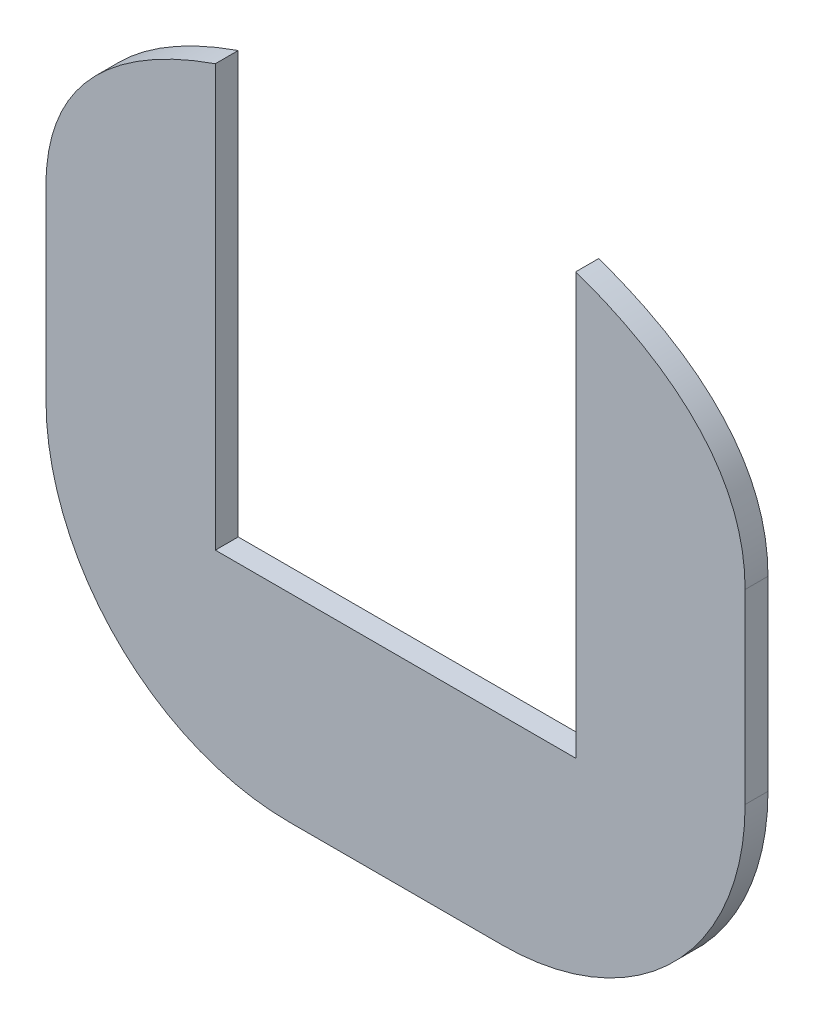
ISO-10303-21;
HEADER;
FILE_DESCRIPTION(('STEP AP214'),'2;1');
FILE_NAME('part.step','',(''),(''),'','','');
FILE_SCHEMA(('AUTOMOTIVE_DESIGN { 1 0 10303 214 1 1 1 1 }'));
ENDSEC;
DATA;
#1=APPLICATION_CONTEXT('core data for automotive mechanical design processes');
#2=APPLICATION_PROTOCOL_DEFINITION('international standard','automotive_design',2000,#1);
#3=PRODUCT_CONTEXT('',#1,'mechanical');
#4=PRODUCT('Part','Part','',(#3));
#5=PRODUCT_RELATED_PRODUCT_CATEGORY('part','',(#4));
#6=PRODUCT_DEFINITION_FORMATION('','',#4);
#7=PRODUCT_DEFINITION_CONTEXT('part definition',#1,'design');
#8=PRODUCT_DEFINITION('design','',#6,#7);
#9=PRODUCT_DEFINITION_SHAPE('','',#8);
#10=(LENGTH_UNIT() NAMED_UNIT(*) SI_UNIT(.MILLI.,.METRE.));
#11=(NAMED_UNIT(*) PLANE_ANGLE_UNIT() SI_UNIT($,.RADIAN.));
#12=(NAMED_UNIT(*) SI_UNIT($,.STERADIAN.) SOLID_ANGLE_UNIT());
#13=UNCERTAINTY_MEASURE_WITH_UNIT(LENGTH_MEASURE(1.E-05),#10,'distance_accuracy_value','');
#14=(GEOMETRIC_REPRESENTATION_CONTEXT(3) GLOBAL_UNCERTAINTY_ASSIGNED_CONTEXT((#13)) GLOBAL_UNIT_ASSIGNED_CONTEXT((#10,
#11,#12)) REPRESENTATION_CONTEXT('',''));
#15=CARTESIAN_POINT('',(0.,0.,0.));
#16=DIRECTION('',(0.,0.,1.));
#17=DIRECTION('',(1.,0.,0.));
#18=AXIS2_PLACEMENT_3D('',#15,#16,#17);
#19=CARTESIAN_POINT('',(-20.,-46.5,4.3));
#20=DIRECTION('',(0.,0.,-1.));
#21=DIRECTION('',(-1.,0.,0.));
#22=AXIS2_PLACEMENT_3D('',#19,#20,#21);
#23=CYLINDRICAL_SURFACE('',#22,45.7);
#24=CARTESIAN_POINT('',(-20.,-46.5,0.));
#25=DIRECTION('',(0.,0.,1.));
#26=DIRECTION('',(1.,0.,0.));
#27=AXIS2_PLACEMENT_3D('',#24,#25,#26);
#28=CIRCLE('',#27,45.7);
#29=CARTESIAN_POINT('',(-65.7,-46.5,0.));
#30=VERTEX_POINT('',#29);
#31=CARTESIAN_POINT('',(-20.,-92.2,0.));
#32=VERTEX_POINT('',#31);
#33=EDGE_CURVE('E177',#30,#32,#28,.T.);
#34=ORIENTED_EDGE('',*,*,#33,.T.);
#35=DIRECTION('',(0.,0.,-1.));
#36=VECTOR('',#35,1.);
#37=CARTESIAN_POINT('',(-20.,-92.2,4.3));
#38=LINE('',#37,#36);
#39=CARTESIAN_POINT('',(-20.,-92.2,4.3));
#40=VERTEX_POINT('',#39);
#41=EDGE_CURVE('E171',#40,#32,#38,.T.);
#42=ORIENTED_EDGE('',*,*,#41,.F.);
#43=CARTESIAN_POINT('',(-20.,-46.5,4.3));
#44=DIRECTION('',(0.,0.,1.));
#45=DIRECTION('',(1.,0.,0.));
#46=AXIS2_PLACEMENT_3D('',#43,#44,#45);
#47=CIRCLE('',#46,45.7);
#48=CARTESIAN_POINT('',(-65.7,-46.5,4.3));
#49=VERTEX_POINT('',#48);
#50=EDGE_CURVE('E201',#49,#40,#47,.T.);
#51=ORIENTED_EDGE('',*,*,#50,.F.);
#52=DIRECTION('',(0.,0.,-1.));
#53=VECTOR('',#52,1.);
#54=CARTESIAN_POINT('',(-65.7,-46.5,4.3));
#55=LINE('',#54,#53);
#56=EDGE_CURVE('E202',#49,#30,#55,.T.);
#57=ORIENTED_EDGE('',*,*,#56,.T.);
#58=EDGE_LOOP('',(#34,#42,#51,#57));
#59=FACE_BOUND('',#58,.T.);
#60=ADVANCED_FACE('F39',(#59),#23,.T.);
#61=CARTESIAN_POINT('',(-14.4294753014943,-92.2,4.3));
#62=DIRECTION('',(0.,1.,0.));
#63=DIRECTION('',(0.,0.,1.));
#64=AXIS2_PLACEMENT_3D('',#61,#62,#63);
#65=PLANE('',#64);
#66=DIRECTION('',(1.,0.,0.));
#67=VECTOR('',#66,1.);
#68=CARTESIAN_POINT('',(-14.4294753014943,-92.2,0.));
#69=LINE('',#68,#67);
#70=CARTESIAN_POINT('',(20.0000000000001,-92.2,0.));
#71=VERTEX_POINT('',#70);
#72=EDGE_CURVE('E167',#32,#71,#69,.T.);
#73=ORIENTED_EDGE('',*,*,#72,.T.);
#74=DIRECTION('',(0.,0.,-1.));
#75=VECTOR('',#74,1.);
#76=CARTESIAN_POINT('',(20.0000000000001,-92.2,4.3));
#77=LINE('',#76,#75);
#78=CARTESIAN_POINT('',(20.0000000000001,-92.2,4.3));
#79=VERTEX_POINT('',#78);
#80=EDGE_CURVE('E169',#79,#71,#77,.T.);
#81=ORIENTED_EDGE('',*,*,#80,.F.);
#82=DIRECTION('',(1.,0.,0.));
#83=VECTOR('',#82,1.);
#84=CARTESIAN_POINT('',(-20.,-92.2,4.3));
#85=LINE('',#84,#83);
#86=EDGE_CURVE('E98',#40,#79,#85,.T.);
#87=ORIENTED_EDGE('',*,*,#86,.F.);
#88=ORIENTED_EDGE('',*,*,#41,.T.);
#89=EDGE_LOOP('',(#73,#81,#87,#88));
#90=FACE_BOUND('',#89,.T.);
#91=ADVANCED_FACE('F160',(#90),#65,.F.);
#92=CARTESIAN_POINT('',(20.0000000000001,-46.5,4.3));
#93=DIRECTION('',(0.,0.,-1.));
#94=DIRECTION('',(-1.,0.,0.));
#95=AXIS2_PLACEMENT_3D('',#92,#93,#94);
#96=CYLINDRICAL_SURFACE('',#95,45.7);
#97=CARTESIAN_POINT('',(20.0000000000001,-46.5,0.));
#98=DIRECTION('',(0.,0.,1.));
#99=DIRECTION('',(1.,0.,0.));
#100=AXIS2_PLACEMENT_3D('',#97,#98,#99);
#101=CIRCLE('',#100,45.7);
#102=CARTESIAN_POINT('',(65.7000000000001,-46.5,0.));
#103=VERTEX_POINT('',#102);
#104=EDGE_CURVE('E176',#71,#103,#101,.T.);
#105=ORIENTED_EDGE('',*,*,#104,.T.);
#106=DIRECTION('',(0.,0.,-1.));
#107=VECTOR('',#106,1.);
#108=CARTESIAN_POINT('',(65.7000000000001,-46.5,4.3));
#109=LINE('',#108,#107);
#110=CARTESIAN_POINT('',(65.7000000000001,-46.5,4.3));
#111=VERTEX_POINT('',#110);
#112=EDGE_CURVE('E129',#111,#103,#109,.T.);
#113=ORIENTED_EDGE('',*,*,#112,.F.);
#114=CARTESIAN_POINT('',(20.0000000000001,-46.5,4.3));
#115=DIRECTION('',(0.,0.,1.));
#116=DIRECTION('',(1.,0.,0.));
#117=AXIS2_PLACEMENT_3D('',#114,#115,#116);
#118=CIRCLE('',#117,45.7);
#119=EDGE_CURVE('E116',#79,#111,#118,.T.);
#120=ORIENTED_EDGE('',*,*,#119,.F.);
#121=ORIENTED_EDGE('',*,*,#80,.T.);
#122=EDGE_LOOP('',(#105,#113,#120,#121));
#123=FACE_BOUND('',#122,.T.);
#124=ADVANCED_FACE('F158',(#123),#96,.T.);
#125=CARTESIAN_POINT('',(65.7,-11.5,4.3));
#126=DIRECTION('',(-1.,0.,0.));
#127=DIRECTION('',(0.,-1.,0.));
#128=AXIS2_PLACEMENT_3D('',#125,#126,#127);
#129=PLANE('',#128);
#130=DIRECTION('',(0.,1.,0.));
#131=VECTOR('',#130,1.);
#132=CARTESIAN_POINT('',(65.7,-11.5,0.));
#133=LINE('',#132,#131);
#134=CARTESIAN_POINT('',(65.7,-11.5,0.));
#135=VERTEX_POINT('',#134);
#136=EDGE_CURVE('E125',#103,#135,#133,.T.);
#137=ORIENTED_EDGE('',*,*,#136,.T.);
#138=DIRECTION('',(0.,0.,-1.));
#139=VECTOR('',#138,1.);
#140=CARTESIAN_POINT('',(65.7,-11.5,4.3));
#141=LINE('',#140,#139);
#142=CARTESIAN_POINT('',(65.7,-11.5,4.3));
#143=VERTEX_POINT('',#142);
#144=EDGE_CURVE('E122',#143,#135,#141,.T.);
#145=ORIENTED_EDGE('',*,*,#144,.F.);
#146=DIRECTION('',(0.,1.,0.));
#147=VECTOR('',#146,1.);
#148=CARTESIAN_POINT('',(65.7,-11.5,4.3));
#149=LINE('',#148,#147);
#150=EDGE_CURVE('E108',#111,#143,#149,.T.);
#151=ORIENTED_EDGE('',*,*,#150,.F.);
#152=ORIENTED_EDGE('',*,*,#112,.T.);
#153=EDGE_LOOP('',(#137,#145,#151,#152));
#154=FACE_BOUND('',#153,.T.);
#155=ADVANCED_FACE('F123',(#154),#129,.F.);
#156=CARTESIAN_POINT('',(65.7,-11.5,4.3));
#157=CARTESIAN_POINT('',(65.7,-10.9755899583671,4.3));
#158=CARTESIAN_POINT('',(65.677234407799,-9.91549097796304,4.3));
#159=CARTESIAN_POINT('',(65.5441870414575,-7.88841293925266,4.3));
#160=CARTESIAN_POINT('',(65.220242617562,-5.46067195182682,4.3));
#161=CARTESIAN_POINT('',(64.5980627687172,-2.72371582524321,4.3));
#162=CARTESIAN_POINT('',(63.4785155326464,0.716203599535267,4.3));
#163=CARTESIAN_POINT('',(61.5699490088853,4.65452752002481,4.3));
#164=CARTESIAN_POINT('',(58.5534228762426,8.88527505087892,4.3));
#165=CARTESIAN_POINT('',(54.896250472532,12.6626147651157,4.3));
#166=CARTESIAN_POINT('',(49.3051589495504,17.1177502677086,4.3));
#167=CARTESIAN_POINT('',(41.2794443055255,21.6169423973493,4.3));
#168=CARTESIAN_POINT('',(32.8026150450985,24.7807297336521,4.3));
#169=CARTESIAN_POINT('',(26.3389158503498,26.6062450199433,4.3));
#170=CARTESIAN_POINT('',(21.7972115308563,27.6517809376323,4.3));
#171=CARTESIAN_POINT('',(17.7102182701353,28.403936400297,4.3));
#172=CARTESIAN_POINT('',(14.8086873614499,28.8127381630495,4.3));
#173=CARTESIAN_POINT('',(12.8723127777568,29.0253496461649,4.3));
#174=CARTESIAN_POINT('',(11.6336485809542,29.1318563530486,4.3));
#175=CARTESIAN_POINT('',(10.8115232746335,29.1802031883283,4.3));
#176=CARTESIAN_POINT('',(10.2829881458273,29.1975933707137,4.3));
#177=CARTESIAN_POINT('',(10.1012123889315,29.2,4.3));
#178=CARTESIAN_POINT('',(10.,29.2,4.3));
#179=B_SPLINE_CURVE_WITH_KNOTS('',3,(#156,#157,#158,#159,#160,#161,#162,#163,#164,#165,#166,
#167,#168,#169,#170,#171,#172,#173,#174,#175,#176,#177,#178),.UNSPECIFIED.,.F.,.F.,(4,1,1,1,1,1,
1,1,1,1,1,1,1,1,1,1,1,1,1,1,4),(0.,0.015625,0.03125,0.0625,0.09375,0.125,0.1875,0.25,0.3125,
0.375,0.5,0.625,0.6875,0.75,0.8125,0.875,0.90625,0.9375,0.96875,0.984375,1.),.UNSPECIFIED.);
#180=DIRECTION('',(0.,0.,-1.));
#181=VECTOR('',#180,1.);
#182=SURFACE_OF_LINEAR_EXTRUSION('',#179,#181);
#183=CARTESIAN_POINT('',(65.7,-11.5,0.));
#184=CARTESIAN_POINT('',(65.7,-10.9755899583671,0.));
#185=CARTESIAN_POINT('',(65.677234407799,-9.91549097796304,0.));
#186=CARTESIAN_POINT('',(65.5441870414575,-7.88841293925266,0.));
#187=CARTESIAN_POINT('',(65.220242617562,-5.46067195182682,0.));
#188=CARTESIAN_POINT('',(64.5980627687172,-2.72371582524321,0.));
#189=CARTESIAN_POINT('',(63.4785155326464,0.716203599535267,0.));
#190=CARTESIAN_POINT('',(61.5699490088853,4.65452752002481,0.));
#191=CARTESIAN_POINT('',(58.5534228762426,8.88527505087892,0.));
#192=CARTESIAN_POINT('',(54.896250472532,12.6626147651157,0.));
#193=CARTESIAN_POINT('',(49.3051589495504,17.1177502677086,0.));
#194=CARTESIAN_POINT('',(41.2794443055255,21.6169423973493,0.));
#195=CARTESIAN_POINT('',(32.8026150450985,24.7807297336521,0.));
#196=CARTESIAN_POINT('',(26.3389158503498,26.6062450199433,0.));
#197=CARTESIAN_POINT('',(21.7972115308563,27.6517809376323,0.));
#198=CARTESIAN_POINT('',(17.7102182701353,28.403936400297,0.));
#199=CARTESIAN_POINT('',(14.8086873614499,28.8127381630495,0.));
#200=CARTESIAN_POINT('',(12.8723127777568,29.0253496461649,0.));
#201=CARTESIAN_POINT('',(11.6336485809542,29.1318563530486,0.));
#202=CARTESIAN_POINT('',(10.8115232746335,29.1802031883283,0.));
#203=CARTESIAN_POINT('',(10.2829881458273,29.1975933707137,0.));
#204=CARTESIAN_POINT('',(10.1012123889315,29.2,0.));
#205=CARTESIAN_POINT('',(10.,29.2,0.));
#206=B_SPLINE_CURVE_WITH_KNOTS('',3,(#183,#184,#185,#186,#187,#188,#189,#190,#191,#192,#193,
#194,#195,#196,#197,#198,#199,#200,#201,#202,#203,#204,#205),.UNSPECIFIED.,.F.,.F.,(4,1,1,1,1,1,
1,1,1,1,1,1,1,1,1,1,1,1,1,1,4),(0.,0.015625,0.03125,0.0625,0.09375,0.125,0.1875,0.25,0.3125,
0.375,0.5,0.625,0.6875,0.75,0.8125,0.875,0.90625,0.9375,0.96875,0.984375,1.),.UNSPECIFIED.);
#207=CARTESIAN_POINT('',(33.87,24.2997486559745,0.));
#208=VERTEX_POINT('',#207);
#209=EDGE_CURVE('E183',#135,#208,#206,.T.);
#210=ORIENTED_EDGE('',*,*,#209,.T.);
#211=DIRECTION('',(0.,0.,-1.));
#212=VECTOR('',#211,1.);
#213=CARTESIAN_POINT('',(33.87,24.2997486559022,4.3));
#214=LINE('',#213,#212);
#215=CARTESIAN_POINT('',(33.87,24.2997486559745,4.3));
#216=VERTEX_POINT('',#215);
#217=EDGE_CURVE('E135',#208,#216,#214,.F.);
#218=ORIENTED_EDGE('',*,*,#217,.T.);
#219=EDGE_CURVE('E114',#143,#216,#179,.T.);
#220=ORIENTED_EDGE('',*,*,#219,.F.);
#221=ORIENTED_EDGE('',*,*,#144,.T.);
#222=EDGE_LOOP('',(#210,#218,#220,#221));
#223=FACE_BOUND('',#222,.T.);
#224=ADVANCED_FACE('F133',(#223),#182,.F.);
#225=CARTESIAN_POINT('',(-10.,29.2,4.3));
#226=CARTESIAN_POINT('',(-10.1012123889315,29.2,4.3));
#227=CARTESIAN_POINT('',(-10.2829881458273,29.1975933707137,4.3));
#228=CARTESIAN_POINT('',(-10.8115232746335,29.1802031883283,4.3));
#229=CARTESIAN_POINT('',(-11.6336485809542,29.1318563530485,4.3));
#230=CARTESIAN_POINT('',(-12.8723127777568,29.0253496461649,4.3));
#231=CARTESIAN_POINT('',(-14.80868736145,28.8127381630495,4.3));
#232=CARTESIAN_POINT('',(-17.7102182701353,28.403936400297,4.3));
#233=CARTESIAN_POINT('',(-21.7972115308563,27.6517809376323,4.3));
#234=CARTESIAN_POINT('',(-26.3389158503498,26.6062450199433,4.3));
#235=CARTESIAN_POINT('',(-32.8026150450985,24.7807297336521,4.3));
#236=CARTESIAN_POINT('',(-41.2794443055255,21.6169423973493,4.3));
#237=CARTESIAN_POINT('',(-49.3051589495504,17.1177502677086,4.3));
#238=CARTESIAN_POINT('',(-54.896250472532,12.6626147651157,4.3));
#239=CARTESIAN_POINT('',(-58.5534228762426,8.88527505087891,4.3));
#240=CARTESIAN_POINT('',(-61.5699490088853,4.6545275200248,4.3));
#241=CARTESIAN_POINT('',(-63.4785155326464,0.716203599535257,4.3));
#242=CARTESIAN_POINT('',(-64.5980627687172,-2.72371582524323,4.3));
#243=CARTESIAN_POINT('',(-65.220242617562,-5.46067195182683,4.3));
#244=CARTESIAN_POINT('',(-65.5441870414575,-7.88841293925267,4.3));
#245=CARTESIAN_POINT('',(-65.677234407799,-9.91549097796306,4.3));
#246=CARTESIAN_POINT('',(-65.7,-10.9755899583671,4.3));
#247=CARTESIAN_POINT('',(-65.7,-11.5,4.3));
#248=B_SPLINE_CURVE_WITH_KNOTS('',3,(#225,#226,#227,#228,#229,#230,#231,#232,#233,#234,#235,
#236,#237,#238,#239,#240,#241,#242,#243,#244,#245,#246,#247),.UNSPECIFIED.,.F.,.F.,(4,1,1,1,1,1,
1,1,1,1,1,1,1,1,1,1,1,1,1,1,4),(0.,0.015625,0.03125,0.0625,0.09375,0.125,0.1875,0.25,0.3125,
0.375,0.5,0.625,0.6875,0.75,0.8125,0.875,0.90625,0.9375,0.96875,0.984375,1.),.UNSPECIFIED.);
#249=DIRECTION('',(0.,0.,-1.));
#250=VECTOR('',#249,1.);
#251=SURFACE_OF_LINEAR_EXTRUSION('',#248,#250);
#252=CARTESIAN_POINT('',(-33.87,24.2997486525097,4.3));
#253=VERTEX_POINT('',#252);
#254=CARTESIAN_POINT('',(-65.7,-11.5,4.3));
#255=VERTEX_POINT('',#254);
#256=EDGE_CURVE('E136',#253,#255,#248,.T.);
#257=ORIENTED_EDGE('',*,*,#256,.F.);
#258=DIRECTION('',(0.,0.,-1.));
#259=VECTOR('',#258,1.);
#260=CARTESIAN_POINT('',(-33.87,24.2997486559022,4.3));
#261=LINE('',#260,#259);
#262=CARTESIAN_POINT('',(-33.87,24.2997486525097,0.));
#263=VERTEX_POINT('',#262);
#264=EDGE_CURVE('E226',#253,#263,#261,.T.);
#265=ORIENTED_EDGE('',*,*,#264,.T.);
#266=CARTESIAN_POINT('',(-10.,29.2,0.));
#267=CARTESIAN_POINT('',(-10.1012123889315,29.2,0.));
#268=CARTESIAN_POINT('',(-10.2829881458273,29.1975933707137,0.));
#269=CARTESIAN_POINT('',(-10.8115232746335,29.1802031883283,0.));
#270=CARTESIAN_POINT('',(-11.6336485809542,29.1318563530485,0.));
#271=CARTESIAN_POINT('',(-12.8723127777568,29.0253496461649,0.));
#272=CARTESIAN_POINT('',(-14.80868736145,28.8127381630495,0.));
#273=CARTESIAN_POINT('',(-17.7102182701353,28.403936400297,0.));
#274=CARTESIAN_POINT('',(-21.7972115308563,27.6517809376323,0.));
#275=CARTESIAN_POINT('',(-26.3389158503498,26.6062450199433,0.));
#276=CARTESIAN_POINT('',(-32.8026150450985,24.7807297336521,0.));
#277=CARTESIAN_POINT('',(-41.2794443055255,21.6169423973493,0.));
#278=CARTESIAN_POINT('',(-49.3051589495504,17.1177502677086,0.));
#279=CARTESIAN_POINT('',(-54.896250472532,12.6626147651157,0.));
#280=CARTESIAN_POINT('',(-58.5534228762426,8.88527505087891,0.));
#281=CARTESIAN_POINT('',(-61.5699490088853,4.6545275200248,0.));
#282=CARTESIAN_POINT('',(-63.4785155326464,0.716203599535257,0.));
#283=CARTESIAN_POINT('',(-64.5980627687172,-2.72371582524323,0.));
#284=CARTESIAN_POINT('',(-65.220242617562,-5.46067195182683,0.));
#285=CARTESIAN_POINT('',(-65.5441870414575,-7.88841293925267,0.));
#286=CARTESIAN_POINT('',(-65.677234407799,-9.91549097796306,0.));
#287=CARTESIAN_POINT('',(-65.7,-10.9755899583671,0.));
#288=CARTESIAN_POINT('',(-65.7,-11.5,0.));
#289=B_SPLINE_CURVE_WITH_KNOTS('',3,(#266,#267,#268,#269,#270,#271,#272,#273,#274,#275,#276,
#277,#278,#279,#280,#281,#282,#283,#284,#285,#286,#287,#288),.UNSPECIFIED.,.F.,.F.,(4,1,1,1,1,1,
1,1,1,1,1,1,1,1,1,1,1,1,1,1,4),(0.,0.015625,0.03125,0.0625,0.09375,0.125,0.1875,0.25,0.3125,
0.375,0.5,0.625,0.6875,0.75,0.8125,0.875,0.90625,0.9375,0.96875,0.984375,1.),.UNSPECIFIED.);
#290=CARTESIAN_POINT('',(-65.7,-11.5,0.));
#291=VERTEX_POINT('',#290);
#292=EDGE_CURVE('E190',#263,#291,#289,.T.);
#293=ORIENTED_EDGE('',*,*,#292,.T.);
#294=DIRECTION('',(0.,0.,-1.));
#295=VECTOR('',#294,1.);
#296=CARTESIAN_POINT('',(-65.7,-11.5,4.3));
#297=LINE('',#296,#295);
#298=EDGE_CURVE('E130',#255,#291,#297,.T.);
#299=ORIENTED_EDGE('',*,*,#298,.F.);
#300=EDGE_LOOP('',(#257,#265,#293,#299));
#301=FACE_BOUND('',#300,.T.);
#302=ADVANCED_FACE('F154',(#301),#251,.F.);
#303=CARTESIAN_POINT('',(-65.7,-11.5,4.3));
#304=DIRECTION('',(1.,0.,0.));
#305=DIRECTION('',(0.,1.,0.));
#306=AXIS2_PLACEMENT_3D('',#303,#304,#305);
#307=PLANE('',#306);
#308=DIRECTION('',(0.,-1.,0.));
#309=VECTOR('',#308,1.);
#310=CARTESIAN_POINT('',(-65.7,-11.5,0.));
#311=LINE('',#310,#309);
#312=EDGE_CURVE('E89',#291,#30,#311,.T.);
#313=ORIENTED_EDGE('',*,*,#312,.T.);
#314=ORIENTED_EDGE('',*,*,#56,.F.);
#315=DIRECTION('',(0.,-1.,0.));
#316=VECTOR('',#315,1.);
#317=CARTESIAN_POINT('',(-65.7,-11.5,4.3));
#318=LINE('',#317,#316);
#319=EDGE_CURVE('E62',#255,#49,#318,.T.);
#320=ORIENTED_EDGE('',*,*,#319,.F.);
#321=ORIENTED_EDGE('',*,*,#298,.T.);
#322=EDGE_LOOP('',(#313,#314,#320,#321));
#323=FACE_BOUND('',#322,.T.);
#324=ADVANCED_FACE('F244',(#323),#307,.F.);
#325=CARTESIAN_POINT('',(-20.,-46.5,4.3));
#326=DIRECTION('',(0.,0.,1.));
#327=DIRECTION('',(1.,0.,0.));
#328=AXIS2_PLACEMENT_3D('',#325,#326,#327);
#329=PLANE('',#328);
#330=DIRECTION('',(0.,1.,0.));
#331=VECTOR('',#330,1.);
#332=CARTESIAN_POINT('',(33.87,24.2997486559022,4.3));
#333=LINE('',#332,#331);
#334=CARTESIAN_POINT('',(33.87,-54.8802513440978,4.3));
#335=VERTEX_POINT('',#334);
#336=EDGE_CURVE('E230',#335,#216,#333,.T.);
#337=ORIENTED_EDGE('',*,*,#336,.F.);
#338=DIRECTION('',(1.,0.,0.));
#339=VECTOR('',#338,1.);
#340=CARTESIAN_POINT('',(-33.87,-54.8802513440978,4.3));
#341=LINE('',#340,#339);
#342=CARTESIAN_POINT('',(-33.87,-54.8802513440978,4.3));
#343=VERTEX_POINT('',#342);
#344=EDGE_CURVE('E223',#343,#335,#341,.T.);
#345=ORIENTED_EDGE('',*,*,#344,.F.);
#346=DIRECTION('',(0.,-1.,0.));
#347=VECTOR('',#346,1.);
#348=CARTESIAN_POINT('',(-33.87,24.2997486559022,4.3));
#349=LINE('',#348,#347);
#350=EDGE_CURVE('E270',#253,#343,#349,.T.);
#351=ORIENTED_EDGE('',*,*,#350,.F.);
#352=ORIENTED_EDGE('',*,*,#256,.T.);
#353=ORIENTED_EDGE('',*,*,#319,.T.);
#354=ORIENTED_EDGE('',*,*,#50,.T.);
#355=ORIENTED_EDGE('',*,*,#86,.T.);
#356=ORIENTED_EDGE('',*,*,#119,.T.);
#357=ORIENTED_EDGE('',*,*,#150,.T.);
#358=ORIENTED_EDGE('',*,*,#219,.T.);
#359=EDGE_LOOP('',(#337,#345,#351,#352,#353,#354,#355,#356,#357,#358));
#360=FACE_BOUND('',#359,.T.);
#361=ADVANCED_FACE('F111',(#360),#329,.T.);
#362=CARTESIAN_POINT('',(-20.,-46.5,0.));
#363=DIRECTION('',(0.,0.,1.));
#364=DIRECTION('',(1.,0.,0.));
#365=AXIS2_PLACEMENT_3D('',#362,#363,#364);
#366=PLANE('',#365);
#367=DIRECTION('',(1.,0.,0.));
#368=VECTOR('',#367,1.);
#369=CARTESIAN_POINT('',(-20.,-54.8802513440978,0.));
#370=LINE('',#369,#368);
#371=CARTESIAN_POINT('',(-33.87,-54.8802513440978,0.));
#372=VERTEX_POINT('',#371);
#373=CARTESIAN_POINT('',(33.87,-54.8802513440978,0.));
#374=VERTEX_POINT('',#373);
#375=EDGE_CURVE('E46',#372,#374,#370,.T.);
#376=ORIENTED_EDGE('',*,*,#375,.T.);
#377=DIRECTION('',(0.,1.,0.));
#378=VECTOR('',#377,1.);
#379=CARTESIAN_POINT('',(33.87,-46.5,0.));
#380=LINE('',#379,#378);
#381=EDGE_CURVE('E11',#374,#208,#380,.T.);
#382=ORIENTED_EDGE('',*,*,#381,.T.);
#383=ORIENTED_EDGE('',*,*,#209,.F.);
#384=ORIENTED_EDGE('',*,*,#136,.F.);
#385=ORIENTED_EDGE('',*,*,#104,.F.);
#386=ORIENTED_EDGE('',*,*,#72,.F.);
#387=ORIENTED_EDGE('',*,*,#33,.F.);
#388=ORIENTED_EDGE('',*,*,#312,.F.);
#389=ORIENTED_EDGE('',*,*,#292,.F.);
#390=DIRECTION('',(0.,-1.,0.));
#391=VECTOR('',#390,1.);
#392=CARTESIAN_POINT('',(-33.87,-46.5,0.));
#393=LINE('',#392,#391);
#394=EDGE_CURVE('E207',#263,#372,#393,.T.);
#395=ORIENTED_EDGE('',*,*,#394,.T.);
#396=EDGE_LOOP('',(#376,#382,#383,#384,#385,#386,#387,#388,#389,#395));
#397=FACE_BOUND('',#396,.T.);
#398=ADVANCED_FACE('F181',(#397),#366,.F.);
#399=CARTESIAN_POINT('',(33.87,24.2997486559022,-5.7));
#400=DIRECTION('',(1.,0.,0.));
#401=DIRECTION('',(0.,0.,-1.));
#402=AXIS2_PLACEMENT_3D('',#399,#400,#401);
#403=PLANE('',#402);
#404=ORIENTED_EDGE('',*,*,#381,.F.);
#405=DIRECTION('',(0.,0.,1.));
#406=VECTOR('',#405,1.);
#407=CARTESIAN_POINT('',(33.87,-54.8802513440978,-5.7));
#408=LINE('',#407,#406);
#409=EDGE_CURVE('E220',#374,#335,#408,.T.);
#410=ORIENTED_EDGE('',*,*,#409,.T.);
#411=ORIENTED_EDGE('',*,*,#336,.T.);
#412=ORIENTED_EDGE('',*,*,#217,.F.);
#413=EDGE_LOOP('',(#404,#410,#411,#412));
#414=FACE_BOUND('',#413,.T.);
#415=ADVANCED_FACE('F255',(#414),#403,.F.);
#416=CARTESIAN_POINT('',(-33.87,-54.8802513440978,-5.7));
#417=DIRECTION('',(0.,-1.,0.));
#418=DIRECTION('',(0.,0.,-1.));
#419=AXIS2_PLACEMENT_3D('',#416,#417,#418);
#420=PLANE('',#419);
#421=DIRECTION('',(0.,0.,1.));
#422=VECTOR('',#421,1.);
#423=CARTESIAN_POINT('',(-33.87,-54.8802513440978,-5.7));
#424=LINE('',#423,#422);
#425=EDGE_CURVE('E53',#372,#343,#424,.T.);
#426=ORIENTED_EDGE('',*,*,#425,.T.);
#427=ORIENTED_EDGE('',*,*,#344,.T.);
#428=ORIENTED_EDGE('',*,*,#409,.F.);
#429=ORIENTED_EDGE('',*,*,#375,.F.);
#430=EDGE_LOOP('',(#426,#427,#428,#429));
#431=FACE_BOUND('',#430,.T.);
#432=ADVANCED_FACE('F216',(#431),#420,.F.);
#433=CARTESIAN_POINT('',(-33.87,24.2997486559022,-5.7));
#434=DIRECTION('',(-1.,0.,0.));
#435=DIRECTION('',(0.,-1.,0.));
#436=AXIS2_PLACEMENT_3D('',#433,#434,#435);
#437=PLANE('',#436);
#438=ORIENTED_EDGE('',*,*,#350,.T.);
#439=ORIENTED_EDGE('',*,*,#425,.F.);
#440=ORIENTED_EDGE('',*,*,#394,.F.);
#441=ORIENTED_EDGE('',*,*,#264,.F.);
#442=EDGE_LOOP('',(#438,#439,#440,#441));
#443=FACE_BOUND('',#442,.T.);
#444=ADVANCED_FACE('F257',(#443),#437,.F.);
#445=CLOSED_SHELL('',(#60,#91,#124,#155,#224,#302,#324,#361,#398,#415,#432,#444));
#446=MANIFOLD_SOLID_BREP('B2',#445);
#447=ADVANCED_BREP_SHAPE_REPRESENTATION('',(#18,#446),#14);
#448=SHAPE_DEFINITION_REPRESENTATION(#9,#447);
ENDSEC;
END-ISO-10303-21;
